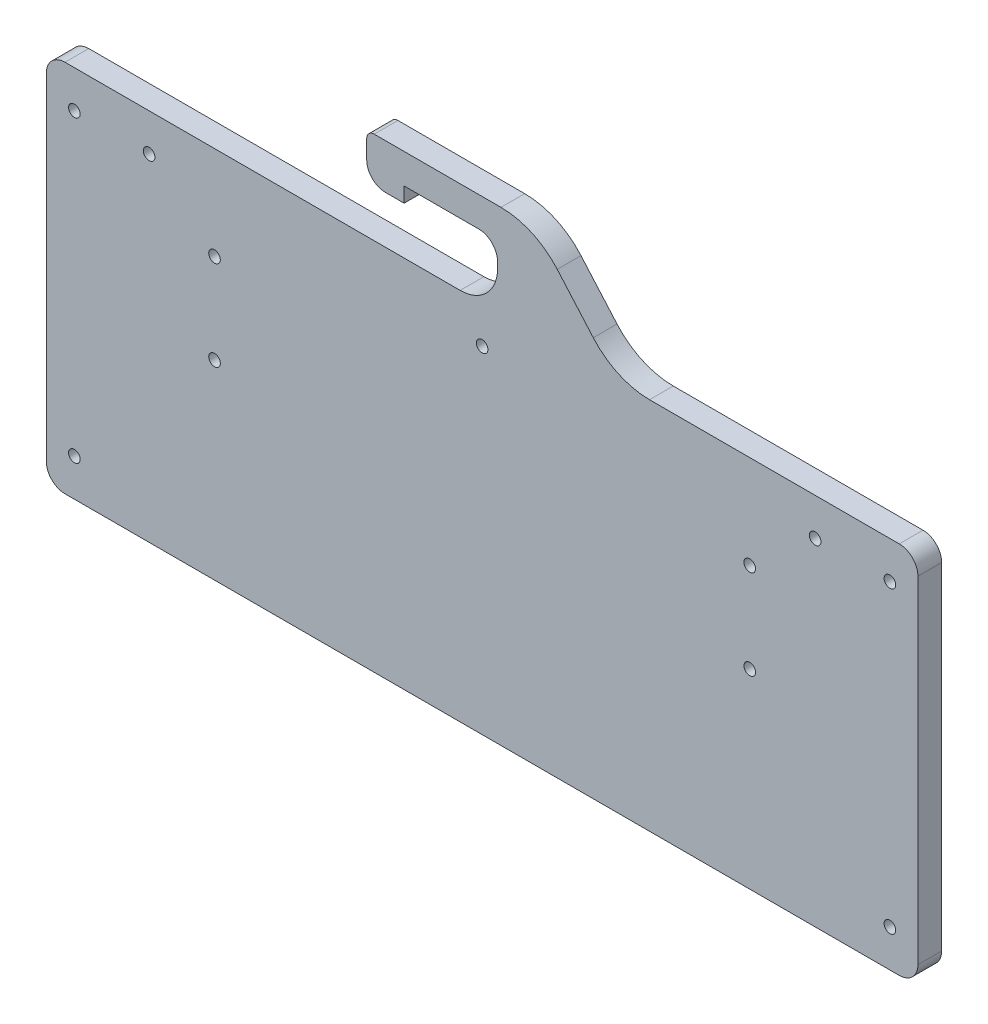
ISO-10303-21;
HEADER;
FILE_DESCRIPTION(('STEP AP214'),'2;1');
FILE_NAME('part.step','',(''),(''),'','','');
FILE_SCHEMA(('AUTOMOTIVE_DESIGN { 1 0 10303 214 1 1 1 1 }'));
ENDSEC;
DATA;
#1=APPLICATION_CONTEXT('core data for automotive mechanical design processes');
#2=APPLICATION_PROTOCOL_DEFINITION('international standard','automotive_design',2000,#1);
#3=PRODUCT_CONTEXT('',#1,'mechanical');
#4=PRODUCT('Part','Part','',(#3));
#5=PRODUCT_RELATED_PRODUCT_CATEGORY('part','',(#4));
#6=PRODUCT_DEFINITION_FORMATION('','',#4);
#7=PRODUCT_DEFINITION_CONTEXT('part definition',#1,'design');
#8=PRODUCT_DEFINITION('design','',#6,#7);
#9=PRODUCT_DEFINITION_SHAPE('','',#8);
#10=(LENGTH_UNIT() NAMED_UNIT(*) SI_UNIT(.MILLI.,.METRE.));
#11=(NAMED_UNIT(*) PLANE_ANGLE_UNIT() SI_UNIT($,.RADIAN.));
#12=(NAMED_UNIT(*) SI_UNIT($,.STERADIAN.) SOLID_ANGLE_UNIT());
#13=UNCERTAINTY_MEASURE_WITH_UNIT(LENGTH_MEASURE(1.E-05),#10,'distance_accuracy_value','');
#14=(GEOMETRIC_REPRESENTATION_CONTEXT(3) GLOBAL_UNCERTAINTY_ASSIGNED_CONTEXT((#13)) GLOBAL_UNIT_ASSIGNED_CONTEXT((#10,
#11,#12)) REPRESENTATION_CONTEXT('',''));
#15=CARTESIAN_POINT('',(0.,0.,0.));
#16=DIRECTION('',(0.,0.,1.));
#17=DIRECTION('',(1.,0.,0.));
#18=AXIS2_PLACEMENT_3D('',#15,#16,#17);
#19=CARTESIAN_POINT('',(0.,0.,6.35));
#20=DIRECTION('',(0.,1.,0.));
#21=DIRECTION('',(0.,0.,1.));
#22=AXIS2_PLACEMENT_3D('',#19,#20,#21);
#23=PLANE('',#22);
#24=DIRECTION('',(1.,0.,0.));
#25=VECTOR('',#24,1.);
#26=CARTESIAN_POINT('',(0.,0.,0.));
#27=LINE('',#26,#25);
#28=CARTESIAN_POINT('',(161.395157905134,0.,0.));
#29=VERTEX_POINT('',#28);
#30=CARTESIAN_POINT('',(228.2,0.,0.));
#31=VERTEX_POINT('',#30);
#32=EDGE_CURVE('E342',#29,#31,#27,.T.);
#33=ORIENTED_EDGE('',*,*,#32,.F.);
#34=DIRECTION('',(0.,0.,1.));
#35=VECTOR('',#34,1.);
#36=CARTESIAN_POINT('',(161.395157905134,0.,6.35));
#37=LINE('',#36,#35);
#38=CARTESIAN_POINT('',(161.395157905134,0.,6.35));
#39=VERTEX_POINT('',#38);
#40=EDGE_CURVE('E466',#29,#39,#37,.T.);
#41=ORIENTED_EDGE('',*,*,#40,.T.);
#42=DIRECTION('',(1.,0.,0.));
#43=VECTOR('',#42,1.);
#44=CARTESIAN_POINT('',(0.,0.,6.35));
#45=LINE('',#44,#43);
#46=CARTESIAN_POINT('',(228.2,0.,6.35));
#47=VERTEX_POINT('',#46);
#48=EDGE_CURVE('E297',#39,#47,#45,.T.);
#49=ORIENTED_EDGE('',*,*,#48,.T.);
#50=DIRECTION('',(0.,0.,-1.));
#51=VECTOR('',#50,1.);
#52=CARTESIAN_POINT('',(228.2,0.,6.35));
#53=LINE('',#52,#51);
#54=EDGE_CURVE('E403',#47,#31,#53,.T.);
#55=ORIENTED_EDGE('',*,*,#54,.T.);
#56=EDGE_LOOP('',(#33,#41,#49,#55));
#57=FACE_BOUND('',#56,.T.);
#58=ADVANCED_FACE('F41',(#57),#23,.T.);
#59=CARTESIAN_POINT('',(5.,0.,6.35));
#60=VERTEX_POINT('',#59);
#61=CARTESIAN_POINT('',(110.723568258825,0.,6.35));
#62=VERTEX_POINT('',#61);
#63=EDGE_CURVE('E298',#60,#62,#45,.T.);
#64=ORIENTED_EDGE('',*,*,#63,.T.);
#65=DIRECTION('',(0.,0.,1.));
#66=VECTOR('',#65,1.);
#67=CARTESIAN_POINT('',(110.723568258825,0.,6.35));
#68=LINE('',#67,#66);
#69=CARTESIAN_POINT('',(110.723568258825,0.,0.));
#70=VERTEX_POINT('',#69);
#71=EDGE_CURVE('E427',#62,#70,#68,.F.);
#72=ORIENTED_EDGE('',*,*,#71,.T.);
#73=CARTESIAN_POINT('',(5.,0.,0.));
#74=VERTEX_POINT('',#73);
#75=EDGE_CURVE('E343',#74,#70,#27,.T.);
#76=ORIENTED_EDGE('',*,*,#75,.F.);
#77=DIRECTION('',(0.,0.,-1.));
#78=VECTOR('',#77,1.);
#79=CARTESIAN_POINT('',(5.,0.,6.35));
#80=LINE('',#79,#78);
#81=EDGE_CURVE('E407',#74,#60,#80,.F.);
#82=ORIENTED_EDGE('',*,*,#81,.T.);
#83=EDGE_LOOP('',(#64,#72,#76,#82));
#84=FACE_BOUND('',#83,.T.);
#85=ADVANCED_FACE('F579',(#84),#23,.T.);
#86=CARTESIAN_POINT('',(0.,0.,6.35));
#87=DIRECTION('',(0.,0.,1.));
#88=DIRECTION('',(1.,0.,0.));
#89=AXIS2_PLACEMENT_3D('',#86,#87,#88);
#90=PLANE('',#89);
#91=CARTESIAN_POINT('',(188.2,-49.,6.35));
#92=DIRECTION('',(0.,0.,-1.));
#93=DIRECTION('',(-1.,0.,0.));
#94=AXIS2_PLACEMENT_3D('',#91,#92,#93);
#95=CIRCLE('',#94,1.55000000000002);
#96=CARTESIAN_POINT('',(186.65,-49.,6.35));
#97=VERTEX_POINT('',#96);
#98=EDGE_CURVE('E245',#97,#97,#95,.T.);
#99=ORIENTED_EDGE('',*,*,#98,.T.);
#100=EDGE_LOOP('',(#99));
#101=FACE_BOUND('',#100,.T.);
#102=CARTESIAN_POINT('',(45.,-49.,6.35));
#103=DIRECTION('',(0.,0.,1.));
#104=DIRECTION('',(1.,0.,0.));
#105=AXIS2_PLACEMENT_3D('',#102,#103,#104);
#106=CIRCLE('',#105,1.55);
#107=CARTESIAN_POINT('',(46.55,-49.,6.35));
#108=VERTEX_POINT('',#107);
#109=EDGE_CURVE('E236',#108,#108,#106,.T.);
#110=ORIENTED_EDGE('',*,*,#109,.F.);
#111=EDGE_LOOP('',(#110));
#112=FACE_BOUND('',#111,.T.);
#113=CARTESIAN_POINT('',(45.,-25.,6.35));
#114=DIRECTION('',(0.,0.,1.));
#115=DIRECTION('',(1.,0.,0.));
#116=AXIS2_PLACEMENT_3D('',#113,#114,#115);
#117=CIRCLE('',#116,1.55);
#118=CARTESIAN_POINT('',(46.55,-25.,6.35));
#119=VERTEX_POINT('',#118);
#120=EDGE_CURVE('E240',#119,#119,#117,.T.);
#121=ORIENTED_EDGE('',*,*,#120,.F.);
#122=EDGE_LOOP('',(#121));
#123=FACE_BOUND('',#122,.T.);
#124=CARTESIAN_POINT('',(116.6,-10.,6.35));
#125=DIRECTION('',(0.,0.,1.));
#126=DIRECTION('',(1.,0.,0.));
#127=AXIS2_PLACEMENT_3D('',#124,#125,#126);
#128=CIRCLE('',#127,1.55000000000001);
#129=CARTESIAN_POINT('',(118.15,-10.,6.35));
#130=VERTEX_POINT('',#129);
#131=EDGE_CURVE('E268',#130,#130,#128,.T.);
#132=ORIENTED_EDGE('',*,*,#131,.F.);
#133=EDGE_LOOP('',(#132));
#134=FACE_BOUND('',#133,.T.);
#135=CARTESIAN_POINT('',(205.7,-10.,6.35));
#136=DIRECTION('',(0.,0.,1.));
#137=DIRECTION('',(1.,0.,0.));
#138=AXIS2_PLACEMENT_3D('',#135,#136,#137);
#139=CIRCLE('',#138,1.54999999999999);
#140=CARTESIAN_POINT('',(207.25,-10.,6.35));
#141=VERTEX_POINT('',#140);
#142=EDGE_CURVE('E272',#141,#141,#139,.T.);
#143=ORIENTED_EDGE('',*,*,#142,.F.);
#144=EDGE_LOOP('',(#143));
#145=FACE_BOUND('',#144,.T.);
#146=CARTESIAN_POINT('',(27.5,-10.,6.35));
#147=DIRECTION('',(0.,0.,1.));
#148=DIRECTION('',(1.,0.,0.));
#149=AXIS2_PLACEMENT_3D('',#146,#147,#148);
#150=CIRCLE('',#149,1.55);
#151=CARTESIAN_POINT('',(29.05,-10.,6.35));
#152=VERTEX_POINT('',#151);
#153=EDGE_CURVE('E277',#152,#152,#150,.T.);
#154=ORIENTED_EDGE('',*,*,#153,.F.);
#155=EDGE_LOOP('',(#154));
#156=FACE_BOUND('',#155,.T.);
#157=CARTESIAN_POINT('',(225.7,-90.,6.35));
#158=DIRECTION('',(0.,0.,1.));
#159=DIRECTION('',(1.,0.,0.));
#160=AXIS2_PLACEMENT_3D('',#157,#158,#159);
#161=CIRCLE('',#160,1.55000000000002);
#162=CARTESIAN_POINT('',(227.25,-90.,6.35));
#163=VERTEX_POINT('',#162);
#164=EDGE_CURVE('E281',#163,#163,#161,.T.);
#165=ORIENTED_EDGE('',*,*,#164,.F.);
#166=EDGE_LOOP('',(#165));
#167=FACE_BOUND('',#166,.T.);
#168=CARTESIAN_POINT('',(225.7,-10.,6.35));
#169=DIRECTION('',(0.,0.,1.));
#170=DIRECTION('',(1.,0.,0.));
#171=AXIS2_PLACEMENT_3D('',#168,#169,#170);
#172=CIRCLE('',#171,1.55000000000002);
#173=CARTESIAN_POINT('',(227.25,-10.,6.35));
#174=VERTEX_POINT('',#173);
#175=EDGE_CURVE('E285',#174,#174,#172,.F.);
#176=ORIENTED_EDGE('',*,*,#175,.T.);
#177=EDGE_LOOP('',(#176));
#178=FACE_BOUND('',#177,.T.);
#179=CARTESIAN_POINT('',(7.5,-10.,6.35));
#180=DIRECTION('',(0.,0.,1.));
#181=DIRECTION('',(1.,0.,0.));
#182=AXIS2_PLACEMENT_3D('',#179,#180,#181);
#183=CIRCLE('',#182,1.55);
#184=CARTESIAN_POINT('',(9.05,-10.,6.35));
#185=VERTEX_POINT('',#184);
#186=EDGE_CURVE('E289',#185,#185,#183,.T.);
#187=ORIENTED_EDGE('',*,*,#186,.F.);
#188=EDGE_LOOP('',(#187));
#189=FACE_BOUND('',#188,.T.);
#190=DIRECTION('',(0.658116071243197,-0.75291648724903,0.));
#191=VECTOR('',#190,1.);
#192=CARTESIAN_POINT('',(86.3440085787674,75.4723540573131,6.35));
#193=LINE('',#192,#191);
#194=CARTESIAN_POINT('',(136.700308357497,17.862321424864,6.35));
#195=VERTEX_POINT('',#194);
#196=CARTESIAN_POINT('',(146.336828160154,6.83767857513608,6.35));
#197=VERTEX_POINT('',#196);
#198=EDGE_CURVE('E504',#195,#197,#193,.T.);
#199=ORIENTED_EDGE('',*,*,#198,.F.);
#200=CARTESIAN_POINT('',(121.641978612516,4.70000000000001,6.34999999999999));
#201=DIRECTION('',(0.,0.,1.));
#202=DIRECTION('',(1.,0.,0.));
#203=AXIS2_PLACEMENT_3D('',#200,#201,#202);
#204=CIRCLE('',#203,20.);
#205=CARTESIAN_POINT('',(121.641978612516,24.7,6.35));
#206=VERTEX_POINT('',#205);
#207=EDGE_CURVE('E457',#195,#206,#204,.T.);
#208=ORIENTED_EDGE('',*,*,#207,.T.);
#209=DIRECTION('',(-1.,0.,0.));
#210=VECTOR('',#209,1.);
#211=CARTESIAN_POINT('',(0.,24.7,6.35));
#212=LINE('',#211,#210);
#213=CARTESIAN_POINT('',(87.7235682588248,24.7,6.35));
#214=VERTEX_POINT('',#213);
#215=EDGE_CURVE('E508',#206,#214,#212,.T.);
#216=ORIENTED_EDGE('',*,*,#215,.T.);
#217=CARTESIAN_POINT('',(87.7235682588248,22.7,6.34999999999999));
#218=DIRECTION('',(0.,0.,1.));
#219=DIRECTION('',(1.,0.,0.));
#220=AXIS2_PLACEMENT_3D('',#217,#218,#219);
#221=CIRCLE('',#220,2.);
#222=CARTESIAN_POINT('',(85.7235682588248,22.7,6.35));
#223=VERTEX_POINT('',#222);
#224=EDGE_CURVE('E441',#214,#223,#221,.T.);
#225=ORIENTED_EDGE('',*,*,#224,.T.);
#226=DIRECTION('',(0.,1.,0.));
#227=VECTOR('',#226,1.);
#228=CARTESIAN_POINT('',(85.7235682588248,0.,6.35));
#229=LINE('',#228,#227);
#230=CARTESIAN_POINT('',(85.7235682588248,17.7,6.35));
#231=VERTEX_POINT('',#230);
#232=EDGE_CURVE('E213',#231,#223,#229,.T.);
#233=ORIENTED_EDGE('',*,*,#232,.F.);
#234=CARTESIAN_POINT('',(90.7235682588248,17.7,6.34999999999999));
#235=DIRECTION('',(0.,0.,1.));
#236=DIRECTION('',(1.,0.,0.));
#237=AXIS2_PLACEMENT_3D('',#234,#235,#236);
#238=CIRCLE('',#237,5.);
#239=CARTESIAN_POINT('',(90.7235682588248,12.7,6.35));
#240=VERTEX_POINT('',#239);
#241=EDGE_CURVE('E211',#231,#240,#238,.T.);
#242=ORIENTED_EDGE('',*,*,#241,.T.);
#243=DIRECTION('',(-1.,0.,0.));
#244=VECTOR('',#243,1.);
#245=CARTESIAN_POINT('',(0.,12.7,6.35));
#246=LINE('',#245,#244);
#247=CARTESIAN_POINT('',(95.7235682588248,12.7,6.35));
#248=VERTEX_POINT('',#247);
#249=EDGE_CURVE('E193',#248,#240,#246,.T.);
#250=ORIENTED_EDGE('',*,*,#249,.F.);
#251=DIRECTION('',(0.,1.,0.));
#252=VECTOR('',#251,1.);
#253=CARTESIAN_POINT('',(95.7235682588248,0.,6.35));
#254=LINE('',#253,#252);
#255=CARTESIAN_POINT('',(95.7235682588248,16.7,6.35));
#256=VERTEX_POINT('',#255);
#257=EDGE_CURVE('E209',#248,#256,#254,.T.);
#258=ORIENTED_EDGE('',*,*,#257,.T.);
#259=DIRECTION('',(-1.,0.,0.));
#260=VECTOR('',#259,1.);
#261=CARTESIAN_POINT('',(0.,16.7,6.35));
#262=LINE('',#261,#260);
#263=CARTESIAN_POINT('',(115.723568258825,16.7,6.35));
#264=VERTEX_POINT('',#263);
#265=EDGE_CURVE('E219',#264,#256,#262,.T.);
#266=ORIENTED_EDGE('',*,*,#265,.F.);
#267=CARTESIAN_POINT('',(115.723568258825,11.7,6.34999999999999));
#268=DIRECTION('',(0.,0.,1.));
#269=DIRECTION('',(1.,0.,0.));
#270=AXIS2_PLACEMENT_3D('',#267,#268,#269);
#271=CIRCLE('',#270,5.);
#272=CARTESIAN_POINT('',(120.723568258825,11.7,6.35));
#273=VERTEX_POINT('',#272);
#274=EDGE_CURVE('E50',#264,#273,#271,.F.);
#275=ORIENTED_EDGE('',*,*,#274,.T.);
#276=DIRECTION('',(0.,1.,0.));
#277=VECTOR('',#276,1.);
#278=CARTESIAN_POINT('',(120.723568258825,0.,6.35));
#279=LINE('',#278,#277);
#280=CARTESIAN_POINT('',(120.723568258825,10.,6.35));
#281=VERTEX_POINT('',#280);
#282=EDGE_CURVE('E203',#281,#273,#279,.T.);
#283=ORIENTED_EDGE('',*,*,#282,.F.);
#284=CARTESIAN_POINT('',(110.723568258825,10.,6.34999999999999));
#285=DIRECTION('',(0.,0.,1.));
#286=DIRECTION('',(1.,0.,0.));
#287=AXIS2_PLACEMENT_3D('',#284,#285,#286);
#288=CIRCLE('',#287,10.);
#289=EDGE_CURVE('E430',#281,#62,#288,.F.);
#290=ORIENTED_EDGE('',*,*,#289,.T.);
#291=ORIENTED_EDGE('',*,*,#63,.F.);
#292=CARTESIAN_POINT('',(5.,-5.,6.35));
#293=DIRECTION('',(0.,0.,1.));
#294=DIRECTION('',(1.,0.,0.));
#295=AXIS2_PLACEMENT_3D('',#292,#293,#294);
#296=CIRCLE('',#295,5.);
#297=CARTESIAN_POINT('',(0.,-5.,6.35));
#298=VERTEX_POINT('',#297);
#299=EDGE_CURVE('E387',#60,#298,#296,.T.);
#300=ORIENTED_EDGE('',*,*,#299,.T.);
#301=DIRECTION('',(0.,-1.,0.));
#302=VECTOR('',#301,1.);
#303=CARTESIAN_POINT('',(0.,0.,6.35));
#304=LINE('',#303,#302);
#305=CARTESIAN_POINT('',(0.,-95.,6.35));
#306=VERTEX_POINT('',#305);
#307=EDGE_CURVE('E302',#298,#306,#304,.T.);
#308=ORIENTED_EDGE('',*,*,#307,.T.);
#309=CARTESIAN_POINT('',(5.,-95.,6.35));
#310=DIRECTION('',(0.,0.,1.));
#311=DIRECTION('',(1.,0.,0.));
#312=AXIS2_PLACEMENT_3D('',#309,#310,#311);
#313=CIRCLE('',#312,5.);
#314=CARTESIAN_POINT('',(5.,-100.,6.35));
#315=VERTEX_POINT('',#314);
#316=EDGE_CURVE('E390',#306,#315,#313,.T.);
#317=ORIENTED_EDGE('',*,*,#316,.T.);
#318=DIRECTION('',(1.,0.,0.));
#319=VECTOR('',#318,1.);
#320=CARTESIAN_POINT('',(0.,-100.,6.35));
#321=LINE('',#320,#319);
#322=CARTESIAN_POINT('',(228.2,-100.,6.35));
#323=VERTEX_POINT('',#322);
#324=EDGE_CURVE('E306',#315,#323,#321,.T.);
#325=ORIENTED_EDGE('',*,*,#324,.T.);
#326=CARTESIAN_POINT('',(228.2,-95.,6.35));
#327=DIRECTION('',(0.,0.,1.));
#328=DIRECTION('',(1.,0.,0.));
#329=AXIS2_PLACEMENT_3D('',#326,#327,#328);
#330=CIRCLE('',#329,5.);
#331=CARTESIAN_POINT('',(233.2,-95.,6.35));
#332=VERTEX_POINT('',#331);
#333=EDGE_CURVE('E393',#323,#332,#330,.T.);
#334=ORIENTED_EDGE('',*,*,#333,.T.);
#335=DIRECTION('',(0.,-1.,0.));
#336=VECTOR('',#335,1.);
#337=CARTESIAN_POINT('',(233.2,0.,6.35));
#338=LINE('',#337,#336);
#339=CARTESIAN_POINT('',(233.2,-5.,6.35));
#340=VERTEX_POINT('',#339);
#341=EDGE_CURVE('E293',#340,#332,#338,.T.);
#342=ORIENTED_EDGE('',*,*,#341,.F.);
#343=CARTESIAN_POINT('',(228.2,-5.,6.35));
#344=DIRECTION('',(0.,0.,1.));
#345=DIRECTION('',(1.,0.,0.));
#346=AXIS2_PLACEMENT_3D('',#343,#344,#345);
#347=CIRCLE('',#346,5.);
#348=EDGE_CURVE('E383',#340,#47,#347,.T.);
#349=ORIENTED_EDGE('',*,*,#348,.T.);
#350=ORIENTED_EDGE('',*,*,#48,.F.);
#351=CARTESIAN_POINT('',(161.395157905134,20.,6.35));
#352=DIRECTION('',(0.,0.,1.));
#353=DIRECTION('',(1.,0.,0.));
#354=AXIS2_PLACEMENT_3D('',#351,#352,#353);
#355=CIRCLE('',#354,20.);
#356=EDGE_CURVE('E470',#39,#197,#355,.F.);
#357=ORIENTED_EDGE('',*,*,#356,.T.);
#358=EDGE_LOOP('',(#199,#208,#216,#225,#233,#242,#250,#258,#266,#275,#283,#290,#291,#300,#308,
#317,#325,#334,#342,#349,#350,#357));
#359=FACE_BOUND('',#358,.T.);
#360=CARTESIAN_POINT('',(7.49999999999999,-90.,6.35));
#361=DIRECTION('',(0.,0.,1.));
#362=DIRECTION('',(1.,0.,0.));
#363=AXIS2_PLACEMENT_3D('',#360,#361,#362);
#364=CIRCLE('',#363,1.55);
#365=CARTESIAN_POINT('',(9.04999999999999,-90.,6.35));
#366=VERTEX_POINT('',#365);
#367=EDGE_CURVE('E310',#366,#366,#364,.F.);
#368=ORIENTED_EDGE('',*,*,#367,.T.);
#369=EDGE_LOOP('',(#368));
#370=FACE_BOUND('',#369,.T.);
#371=CARTESIAN_POINT('',(188.2,-25.,6.35));
#372=DIRECTION('',(0.,0.,-1.));
#373=DIRECTION('',(-1.,0.,0.));
#374=AXIS2_PLACEMENT_3D('',#371,#372,#373);
#375=CIRCLE('',#374,1.55000000000002);
#376=CARTESIAN_POINT('',(186.65,-25.,6.35));
#377=VERTEX_POINT('',#376);
#378=EDGE_CURVE('E253',#377,#377,#375,.T.);
#379=ORIENTED_EDGE('',*,*,#378,.T.);
#380=EDGE_LOOP('',(#379));
#381=FACE_BOUND('',#380,.T.);
#382=ADVANCED_FACE('F207',(#101,#112,#123,#134,#145,#156,#167,#178,#189,#359,#370,#381),#90,.T.);
#383=CARTESIAN_POINT('',(0.,0.,0.));
#384=DIRECTION('',(0.,0.,1.));
#385=DIRECTION('',(1.,0.,0.));
#386=AXIS2_PLACEMENT_3D('',#383,#384,#385);
#387=PLANE('',#386);
#388=CARTESIAN_POINT('',(45.,-49.,0.));
#389=DIRECTION('',(0.,0.,1.));
#390=DIRECTION('',(1.,0.,0.));
#391=AXIS2_PLACEMENT_3D('',#388,#389,#390);
#392=CIRCLE('',#391,1.55);
#393=CARTESIAN_POINT('',(46.55,-49.,0.));
#394=VERTEX_POINT('',#393);
#395=EDGE_CURVE('E241',#394,#394,#392,.T.);
#396=ORIENTED_EDGE('',*,*,#395,.T.);
#397=EDGE_LOOP('',(#396));
#398=FACE_BOUND('',#397,.T.);
#399=CARTESIAN_POINT('',(45.,-25.,0.));
#400=DIRECTION('',(0.,0.,1.));
#401=DIRECTION('',(1.,0.,0.));
#402=AXIS2_PLACEMENT_3D('',#399,#400,#401);
#403=CIRCLE('',#402,1.55);
#404=CARTESIAN_POINT('',(46.55,-25.,0.));
#405=VERTEX_POINT('',#404);
#406=EDGE_CURVE('E260',#405,#405,#403,.T.);
#407=ORIENTED_EDGE('',*,*,#406,.T.);
#408=EDGE_LOOP('',(#407));
#409=FACE_BOUND('',#408,.T.);
#410=CARTESIAN_POINT('',(116.6,-10.,0.));
#411=DIRECTION('',(0.,0.,1.));
#412=DIRECTION('',(1.,0.,0.));
#413=AXIS2_PLACEMENT_3D('',#410,#411,#412);
#414=CIRCLE('',#413,1.55000000000001);
#415=CARTESIAN_POINT('',(118.15,-10.,0.));
#416=VERTEX_POINT('',#415);
#417=EDGE_CURVE('E264',#416,#416,#414,.T.);
#418=ORIENTED_EDGE('',*,*,#417,.T.);
#419=EDGE_LOOP('',(#418));
#420=FACE_BOUND('',#419,.T.);
#421=CARTESIAN_POINT('',(205.7,-10.,0.));
#422=DIRECTION('',(0.,0.,1.));
#423=DIRECTION('',(1.,0.,0.));
#424=AXIS2_PLACEMENT_3D('',#421,#422,#423);
#425=CIRCLE('',#424,1.54999999999999);
#426=CARTESIAN_POINT('',(207.25,-10.,0.));
#427=VERTEX_POINT('',#426);
#428=EDGE_CURVE('E318',#427,#427,#425,.T.);
#429=ORIENTED_EDGE('',*,*,#428,.T.);
#430=EDGE_LOOP('',(#429));
#431=FACE_BOUND('',#430,.T.);
#432=CARTESIAN_POINT('',(27.5,-10.,0.));
#433=DIRECTION('',(0.,0.,1.));
#434=DIRECTION('',(1.,0.,0.));
#435=AXIS2_PLACEMENT_3D('',#432,#433,#434);
#436=CIRCLE('',#435,1.55);
#437=CARTESIAN_POINT('',(29.05,-10.,0.));
#438=VERTEX_POINT('',#437);
#439=EDGE_CURVE('E322',#438,#438,#436,.T.);
#440=ORIENTED_EDGE('',*,*,#439,.T.);
#441=EDGE_LOOP('',(#440));
#442=FACE_BOUND('',#441,.T.);
#443=CARTESIAN_POINT('',(225.7,-90.,0.));
#444=DIRECTION('',(0.,0.,1.));
#445=DIRECTION('',(1.,0.,0.));
#446=AXIS2_PLACEMENT_3D('',#443,#444,#445);
#447=CIRCLE('',#446,1.55000000000002);
#448=CARTESIAN_POINT('',(227.25,-90.,0.));
#449=VERTEX_POINT('',#448);
#450=EDGE_CURVE('E326',#449,#449,#447,.T.);
#451=ORIENTED_EDGE('',*,*,#450,.T.);
#452=EDGE_LOOP('',(#451));
#453=FACE_BOUND('',#452,.T.);
#454=CARTESIAN_POINT('',(225.7,-10.,0.));
#455=DIRECTION('',(0.,0.,1.));
#456=DIRECTION('',(1.,0.,0.));
#457=AXIS2_PLACEMENT_3D('',#454,#455,#456);
#458=CIRCLE('',#457,1.55000000000002);
#459=CARTESIAN_POINT('',(227.25,-10.,0.));
#460=VERTEX_POINT('',#459);
#461=EDGE_CURVE('E330',#460,#460,#458,.F.);
#462=ORIENTED_EDGE('',*,*,#461,.F.);
#463=EDGE_LOOP('',(#462));
#464=FACE_BOUND('',#463,.T.);
#465=CARTESIAN_POINT('',(7.5,-10.,0.));
#466=DIRECTION('',(0.,0.,1.));
#467=DIRECTION('',(1.,0.,0.));
#468=AXIS2_PLACEMENT_3D('',#465,#466,#467);
#469=CIRCLE('',#468,1.55);
#470=CARTESIAN_POINT('',(9.05,-10.,0.));
#471=VERTEX_POINT('',#470);
#472=EDGE_CURVE('E334',#471,#471,#469,.T.);
#473=ORIENTED_EDGE('',*,*,#472,.T.);
#474=EDGE_LOOP('',(#473));
#475=FACE_BOUND('',#474,.T.);
#476=DIRECTION('',(1.,0.,0.));
#477=VECTOR('',#476,1.);
#478=CARTESIAN_POINT('',(0.,24.7,0.));
#479=LINE('',#478,#477);
#480=CARTESIAN_POINT('',(87.7235682588248,24.7,0.));
#481=VERTEX_POINT('',#480);
#482=CARTESIAN_POINT('',(121.641978612516,24.7,0.));
#483=VERTEX_POINT('',#482);
#484=EDGE_CURVE('E230',#481,#483,#479,.T.);
#485=ORIENTED_EDGE('',*,*,#484,.T.);
#486=CARTESIAN_POINT('',(121.641978612516,4.70000000000001,0.));
#487=DIRECTION('',(0.,0.,1.));
#488=DIRECTION('',(1.,0.,0.));
#489=AXIS2_PLACEMENT_3D('',#486,#487,#488);
#490=CIRCLE('',#489,20.);
#491=CARTESIAN_POINT('',(136.700308357497,17.8623214248639,0.));
#492=VERTEX_POINT('',#491);
#493=EDGE_CURVE('E463',#483,#492,#490,.F.);
#494=ORIENTED_EDGE('',*,*,#493,.T.);
#495=DIRECTION('',(-0.658116071243197,0.752916487249031,0.));
#496=VECTOR('',#495,1.);
#497=CARTESIAN_POINT('',(86.3440085787674,75.4723540573131,0.));
#498=LINE('',#497,#496);
#499=CARTESIAN_POINT('',(146.336828160154,6.83767857513605,0.));
#500=VERTEX_POINT('',#499);
#501=EDGE_CURVE('E235',#500,#492,#498,.T.);
#502=ORIENTED_EDGE('',*,*,#501,.F.);
#503=CARTESIAN_POINT('',(161.395157905134,20.,0.));
#504=DIRECTION('',(0.,0.,1.));
#505=DIRECTION('',(1.,0.,0.));
#506=AXIS2_PLACEMENT_3D('',#503,#504,#505);
#507=CIRCLE('',#506,20.);
#508=EDGE_CURVE('E473',#500,#29,#507,.T.);
#509=ORIENTED_EDGE('',*,*,#508,.T.);
#510=ORIENTED_EDGE('',*,*,#32,.T.);
#511=CARTESIAN_POINT('',(228.2,-5.,0.));
#512=DIRECTION('',(0.,0.,1.));
#513=DIRECTION('',(1.,0.,0.));
#514=AXIS2_PLACEMENT_3D('',#511,#512,#513);
#515=CIRCLE('',#514,5.);
#516=CARTESIAN_POINT('',(233.2,-5.,0.));
#517=VERTEX_POINT('',#516);
#518=EDGE_CURVE('E364',#31,#517,#515,.F.);
#519=ORIENTED_EDGE('',*,*,#518,.T.);
#520=DIRECTION('',(0.,-1.,0.));
#521=VECTOR('',#520,1.);
#522=CARTESIAN_POINT('',(233.2,0.,0.));
#523=LINE('',#522,#521);
#524=CARTESIAN_POINT('',(233.2,-95.,0.));
#525=VERTEX_POINT('',#524);
#526=EDGE_CURVE('E338',#517,#525,#523,.T.);
#527=ORIENTED_EDGE('',*,*,#526,.T.);
#528=CARTESIAN_POINT('',(228.2,-95.,0.));
#529=DIRECTION('',(0.,0.,1.));
#530=DIRECTION('',(1.,0.,0.));
#531=AXIS2_PLACEMENT_3D('',#528,#529,#530);
#532=CIRCLE('',#531,5.);
#533=CARTESIAN_POINT('',(228.2,-100.,0.));
#534=VERTEX_POINT('',#533);
#535=EDGE_CURVE('E373',#525,#534,#532,.F.);
#536=ORIENTED_EDGE('',*,*,#535,.T.);
#537=DIRECTION('',(1.,0.,0.));
#538=VECTOR('',#537,1.);
#539=CARTESIAN_POINT('',(0.,-100.,0.));
#540=LINE('',#539,#538);
#541=CARTESIAN_POINT('',(5.,-100.,0.));
#542=VERTEX_POINT('',#541);
#543=EDGE_CURVE('E351',#542,#534,#540,.T.);
#544=ORIENTED_EDGE('',*,*,#543,.F.);
#545=CARTESIAN_POINT('',(5.,-95.,0.));
#546=DIRECTION('',(0.,0.,1.));
#547=DIRECTION('',(1.,0.,0.));
#548=AXIS2_PLACEMENT_3D('',#545,#546,#547);
#549=CIRCLE('',#548,5.);
#550=CARTESIAN_POINT('',(0.,-95.,0.));
#551=VERTEX_POINT('',#550);
#552=EDGE_CURVE('E370',#542,#551,#549,.F.);
#553=ORIENTED_EDGE('',*,*,#552,.T.);
#554=DIRECTION('',(0.,-1.,0.));
#555=VECTOR('',#554,1.);
#556=CARTESIAN_POINT('',(0.,0.,0.));
#557=LINE('',#556,#555);
#558=CARTESIAN_POINT('',(0.,-5.,0.));
#559=VERTEX_POINT('',#558);
#560=EDGE_CURVE('E347',#559,#551,#557,.T.);
#561=ORIENTED_EDGE('',*,*,#560,.F.);
#562=CARTESIAN_POINT('',(5.,-5.,0.));
#563=DIRECTION('',(0.,0.,1.));
#564=DIRECTION('',(1.,0.,0.));
#565=AXIS2_PLACEMENT_3D('',#562,#563,#564);
#566=CIRCLE('',#565,5.);
#567=EDGE_CURVE('E367',#559,#74,#566,.F.);
#568=ORIENTED_EDGE('',*,*,#567,.T.);
#569=ORIENTED_EDGE('',*,*,#75,.T.);
#570=CARTESIAN_POINT('',(110.723568258825,10.,0.));
#571=DIRECTION('',(0.,0.,1.));
#572=DIRECTION('',(1.,0.,0.));
#573=AXIS2_PLACEMENT_3D('',#570,#571,#572);
#574=CIRCLE('',#573,10.);
#575=CARTESIAN_POINT('',(120.723568258825,10.,0.));
#576=VERTEX_POINT('',#575);
#577=EDGE_CURVE('E433',#70,#576,#574,.T.);
#578=ORIENTED_EDGE('',*,*,#577,.T.);
#579=DIRECTION('',(0.,-1.,0.));
#580=VECTOR('',#579,1.);
#581=CARTESIAN_POINT('',(120.723568258825,0.,0.));
#582=LINE('',#581,#580);
#583=CARTESIAN_POINT('',(120.723568258825,11.7,0.));
#584=VERTEX_POINT('',#583);
#585=EDGE_CURVE('E487',#584,#576,#582,.T.);
#586=ORIENTED_EDGE('',*,*,#585,.F.);
#587=CARTESIAN_POINT('',(115.723568258825,11.7,0.));
#588=DIRECTION('',(0.,0.,1.));
#589=DIRECTION('',(1.,0.,0.));
#590=AXIS2_PLACEMENT_3D('',#587,#588,#589);
#591=CIRCLE('',#590,5.);
#592=CARTESIAN_POINT('',(115.723568258825,16.7,0.));
#593=VERTEX_POINT('',#592);
#594=EDGE_CURVE('E11',#584,#593,#591,.T.);
#595=ORIENTED_EDGE('',*,*,#594,.T.);
#596=DIRECTION('',(1.,0.,0.));
#597=VECTOR('',#596,1.);
#598=CARTESIAN_POINT('',(0.,16.7,0.));
#599=LINE('',#598,#597);
#600=CARTESIAN_POINT('',(95.7235682588248,16.7,0.));
#601=VERTEX_POINT('',#600);
#602=EDGE_CURVE('E490',#601,#593,#599,.T.);
#603=ORIENTED_EDGE('',*,*,#602,.F.);
#604=DIRECTION('',(0.,-1.,0.));
#605=VECTOR('',#604,1.);
#606=CARTESIAN_POINT('',(95.7235682588248,0.,0.));
#607=LINE('',#606,#605);
#608=CARTESIAN_POINT('',(95.7235682588248,12.7,0.));
#609=VERTEX_POINT('',#608);
#610=EDGE_CURVE('E494',#601,#609,#607,.T.);
#611=ORIENTED_EDGE('',*,*,#610,.T.);
#612=DIRECTION('',(1.,0.,0.));
#613=VECTOR('',#612,1.);
#614=CARTESIAN_POINT('',(0.,12.7,0.));
#615=LINE('',#614,#613);
#616=CARTESIAN_POINT('',(90.7235682588248,12.7,0.));
#617=VERTEX_POINT('',#616);
#618=EDGE_CURVE('E196',#617,#609,#615,.T.);
#619=ORIENTED_EDGE('',*,*,#618,.F.);
#620=CARTESIAN_POINT('',(90.7235682588248,17.7,0.));
#621=DIRECTION('',(0.,0.,1.));
#622=DIRECTION('',(1.,0.,0.));
#623=AXIS2_PLACEMENT_3D('',#620,#621,#622);
#624=CIRCLE('',#623,5.);
#625=CARTESIAN_POINT('',(85.7235682588248,17.7,0.));
#626=VERTEX_POINT('',#625);
#627=EDGE_CURVE('E419',#617,#626,#624,.F.);
#628=ORIENTED_EDGE('',*,*,#627,.T.);
#629=DIRECTION('',(0.,-1.,0.));
#630=VECTOR('',#629,1.);
#631=CARTESIAN_POINT('',(85.7235682588248,0.,0.));
#632=LINE('',#631,#630);
#633=CARTESIAN_POINT('',(85.7235682588248,22.7,0.));
#634=VERTEX_POINT('',#633);
#635=EDGE_CURVE('E228',#634,#626,#632,.T.);
#636=ORIENTED_EDGE('',*,*,#635,.F.);
#637=CARTESIAN_POINT('',(87.7235682588248,22.7,0.));
#638=DIRECTION('',(0.,0.,1.));
#639=DIRECTION('',(1.,0.,0.));
#640=AXIS2_PLACEMENT_3D('',#637,#638,#639);
#641=CIRCLE('',#640,2.);
#642=EDGE_CURVE('E447',#634,#481,#641,.F.);
#643=ORIENTED_EDGE('',*,*,#642,.T.);
#644=EDGE_LOOP('',(#485,#494,#502,#509,#510,#519,#527,#536,#544,#553,#561,#568,#569,#578,#586,
#595,#603,#611,#619,#628,#636,#643));
#645=FACE_BOUND('',#644,.T.);
#646=CARTESIAN_POINT('',(7.49999999999999,-90.,0.));
#647=DIRECTION('',(0.,0.,1.));
#648=DIRECTION('',(1.,0.,0.));
#649=AXIS2_PLACEMENT_3D('',#646,#647,#648);
#650=CIRCLE('',#649,1.55);
#651=CARTESIAN_POINT('',(9.04999999999999,-90.,0.));
#652=VERTEX_POINT('',#651);
#653=EDGE_CURVE('E273',#652,#652,#650,.F.);
#654=ORIENTED_EDGE('',*,*,#653,.F.);
#655=EDGE_LOOP('',(#654));
#656=FACE_BOUND('',#655,.T.);
#657=CARTESIAN_POINT('',(188.2,-49.,0.));
#658=DIRECTION('',(0.,0.,-1.));
#659=DIRECTION('',(-1.,0.,0.));
#660=AXIS2_PLACEMENT_3D('',#657,#658,#659);
#661=CIRCLE('',#660,1.55000000000002);
#662=CARTESIAN_POINT('',(186.65,-49.,0.));
#663=VERTEX_POINT('',#662);
#664=EDGE_CURVE('E249',#663,#663,#661,.T.);
#665=ORIENTED_EDGE('',*,*,#664,.F.);
#666=EDGE_LOOP('',(#665));
#667=FACE_BOUND('',#666,.T.);
#668=CARTESIAN_POINT('',(188.2,-25.,0.));
#669=DIRECTION('',(0.,0.,-1.));
#670=DIRECTION('',(-1.,0.,0.));
#671=AXIS2_PLACEMENT_3D('',#668,#669,#670);
#672=CIRCLE('',#671,1.55000000000002);
#673=CARTESIAN_POINT('',(186.65,-25.,0.));
#674=VERTEX_POINT('',#673);
#675=EDGE_CURVE('E234',#674,#674,#672,.T.);
#676=ORIENTED_EDGE('',*,*,#675,.F.);
#677=EDGE_LOOP('',(#676));
#678=FACE_BOUND('',#677,.T.);
#679=ADVANCED_FACE('F522',(#398,#409,#420,#431,#442,#453,#464,#475,#645,#656,#667,#678),#387,.F.);
#680=CARTESIAN_POINT('',(233.2,0.,6.35));
#681=DIRECTION('',(1.,0.,0.));
#682=DIRECTION('',(0.,0.,-1.));
#683=AXIS2_PLACEMENT_3D('',#680,#681,#682);
#684=PLANE('',#683);
#685=ORIENTED_EDGE('',*,*,#341,.T.);
#686=DIRECTION('',(0.,0.,-1.));
#687=VECTOR('',#686,1.);
#688=CARTESIAN_POINT('',(233.2,-95.,0.));
#689=LINE('',#688,#687);
#690=EDGE_CURVE('E360',#332,#525,#689,.T.);
#691=ORIENTED_EDGE('',*,*,#690,.T.);
#692=ORIENTED_EDGE('',*,*,#526,.F.);
#693=DIRECTION('',(0.,0.,-1.));
#694=VECTOR('',#693,1.);
#695=CARTESIAN_POINT('',(233.2,-5.,6.35));
#696=LINE('',#695,#694);
#697=EDGE_CURVE('E314',#517,#340,#696,.F.);
#698=ORIENTED_EDGE('',*,*,#697,.T.);
#699=EDGE_LOOP('',(#685,#691,#692,#698));
#700=FACE_BOUND('',#699,.T.);
#701=ADVANCED_FACE('F551',(#700),#684,.T.);
#702=CARTESIAN_POINT('',(0.,0.,6.35));
#703=DIRECTION('',(1.,0.,0.));
#704=DIRECTION('',(0.,0.,-1.));
#705=AXIS2_PLACEMENT_3D('',#702,#703,#704);
#706=PLANE('',#705);
#707=ORIENTED_EDGE('',*,*,#560,.T.);
#708=DIRECTION('',(0.,0.,-1.));
#709=VECTOR('',#708,1.);
#710=CARTESIAN_POINT('',(0.,-95.,6.35));
#711=LINE('',#710,#709);
#712=EDGE_CURVE('E400',#551,#306,#711,.F.);
#713=ORIENTED_EDGE('',*,*,#712,.T.);
#714=ORIENTED_EDGE('',*,*,#307,.F.);
#715=DIRECTION('',(0.,0.,-1.));
#716=VECTOR('',#715,1.);
#717=CARTESIAN_POINT('',(0.,-5.,0.));
#718=LINE('',#717,#716);
#719=EDGE_CURVE('E396',#298,#559,#718,.T.);
#720=ORIENTED_EDGE('',*,*,#719,.T.);
#721=EDGE_LOOP('',(#707,#713,#714,#720));
#722=FACE_BOUND('',#721,.T.);
#723=ADVANCED_FACE('F569',(#722),#706,.F.);
#724=CARTESIAN_POINT('',(0.,-100.,6.35));
#725=DIRECTION('',(0.,1.,0.));
#726=DIRECTION('',(0.,0.,1.));
#727=AXIS2_PLACEMENT_3D('',#724,#725,#726);
#728=PLANE('',#727);
#729=ORIENTED_EDGE('',*,*,#543,.T.);
#730=DIRECTION('',(0.,0.,-1.));
#731=VECTOR('',#730,1.);
#732=CARTESIAN_POINT('',(228.2,-100.,6.35));
#733=LINE('',#732,#731);
#734=EDGE_CURVE('E380',#534,#323,#733,.F.);
#735=ORIENTED_EDGE('',*,*,#734,.T.);
#736=ORIENTED_EDGE('',*,*,#324,.F.);
#737=DIRECTION('',(0.,0.,-1.));
#738=VECTOR('',#737,1.);
#739=CARTESIAN_POINT('',(5.,-100.,6.35));
#740=LINE('',#739,#738);
#741=EDGE_CURVE('E376',#315,#542,#740,.T.);
#742=ORIENTED_EDGE('',*,*,#741,.T.);
#743=EDGE_LOOP('',(#729,#735,#736,#742));
#744=FACE_BOUND('',#743,.T.);
#745=ADVANCED_FACE('F560',(#744),#728,.F.);
#746=CARTESIAN_POINT('',(7.5,-10.,6.35));
#747=DIRECTION('',(0.,0.,-1.));
#748=DIRECTION('',(-1.,0.,0.));
#749=AXIS2_PLACEMENT_3D('',#746,#747,#748);
#750=CYLINDRICAL_SURFACE('',#749,1.55);
#751=ORIENTED_EDGE('',*,*,#186,.T.);
#752=EDGE_LOOP('',(#751));
#753=FACE_BOUND('',#752,.T.);
#754=ORIENTED_EDGE('',*,*,#472,.F.);
#755=EDGE_LOOP('',(#754));
#756=FACE_BOUND('',#755,.T.);
#757=ADVANCED_FACE('F612',(#753,#756),#750,.F.);
#758=CARTESIAN_POINT('',(225.7,-10.,6.35));
#759=DIRECTION('',(0.,0.,-1.));
#760=DIRECTION('',(-1.,0.,0.));
#761=AXIS2_PLACEMENT_3D('',#758,#759,#760);
#762=CYLINDRICAL_SURFACE('',#761,1.55000000000002);
#763=ORIENTED_EDGE('',*,*,#175,.F.);
#764=EDGE_LOOP('',(#763));
#765=FACE_BOUND('',#764,.T.);
#766=ORIENTED_EDGE('',*,*,#461,.T.);
#767=EDGE_LOOP('',(#766));
#768=FACE_BOUND('',#767,.T.);
#769=ADVANCED_FACE('F615',(#765,#768),#762,.F.);
#770=CARTESIAN_POINT('',(225.7,-90.,6.35));
#771=DIRECTION('',(0.,0.,-1.));
#772=DIRECTION('',(-1.,0.,0.));
#773=AXIS2_PLACEMENT_3D('',#770,#771,#772);
#774=CYLINDRICAL_SURFACE('',#773,1.55000000000002);
#775=ORIENTED_EDGE('',*,*,#164,.T.);
#776=EDGE_LOOP('',(#775));
#777=FACE_BOUND('',#776,.T.);
#778=ORIENTED_EDGE('',*,*,#450,.F.);
#779=EDGE_LOOP('',(#778));
#780=FACE_BOUND('',#779,.T.);
#781=ADVANCED_FACE('F619',(#777,#780),#774,.F.);
#782=CARTESIAN_POINT('',(27.5,-10.,6.35));
#783=DIRECTION('',(0.,0.,-1.));
#784=DIRECTION('',(-1.,0.,0.));
#785=AXIS2_PLACEMENT_3D('',#782,#783,#784);
#786=CYLINDRICAL_SURFACE('',#785,1.55);
#787=ORIENTED_EDGE('',*,*,#153,.T.);
#788=EDGE_LOOP('',(#787));
#789=FACE_BOUND('',#788,.T.);
#790=ORIENTED_EDGE('',*,*,#439,.F.);
#791=EDGE_LOOP('',(#790));
#792=FACE_BOUND('',#791,.T.);
#793=ADVANCED_FACE('F623',(#789,#792),#786,.F.);
#794=CARTESIAN_POINT('',(205.7,-10.,6.35));
#795=DIRECTION('',(0.,0.,-1.));
#796=DIRECTION('',(-1.,0.,0.));
#797=AXIS2_PLACEMENT_3D('',#794,#795,#796);
#798=CYLINDRICAL_SURFACE('',#797,1.54999999999999);
#799=ORIENTED_EDGE('',*,*,#142,.T.);
#800=EDGE_LOOP('',(#799));
#801=FACE_BOUND('',#800,.T.);
#802=ORIENTED_EDGE('',*,*,#428,.F.);
#803=EDGE_LOOP('',(#802));
#804=FACE_BOUND('',#803,.T.);
#805=ADVANCED_FACE('F627',(#801,#804),#798,.F.);
#806=CARTESIAN_POINT('',(116.6,-10.,6.35));
#807=DIRECTION('',(0.,0.,-1.));
#808=DIRECTION('',(-1.,0.,0.));
#809=AXIS2_PLACEMENT_3D('',#806,#807,#808);
#810=CYLINDRICAL_SURFACE('',#809,1.55000000000001);
#811=ORIENTED_EDGE('',*,*,#131,.T.);
#812=EDGE_LOOP('',(#811));
#813=FACE_BOUND('',#812,.T.);
#814=ORIENTED_EDGE('',*,*,#417,.F.);
#815=EDGE_LOOP('',(#814));
#816=FACE_BOUND('',#815,.T.);
#817=ADVANCED_FACE('F631',(#813,#816),#810,.F.);
#818=CARTESIAN_POINT('',(7.49999999999999,-90.,6.35));
#819=DIRECTION('',(0.,0.,-1.));
#820=DIRECTION('',(-1.,0.,0.));
#821=AXIS2_PLACEMENT_3D('',#818,#819,#820);
#822=CYLINDRICAL_SURFACE('',#821,1.55);
#823=ORIENTED_EDGE('',*,*,#367,.F.);
#824=EDGE_LOOP('',(#823));
#825=FACE_BOUND('',#824,.T.);
#826=ORIENTED_EDGE('',*,*,#653,.T.);
#827=EDGE_LOOP('',(#826));
#828=FACE_BOUND('',#827,.T.);
#829=ADVANCED_FACE('F635',(#825,#828),#822,.F.);
#830=CARTESIAN_POINT('',(228.2,-95.,6.35));
#831=DIRECTION('',(0.,0.,1.));
#832=DIRECTION('',(1.,0.,0.));
#833=AXIS2_PLACEMENT_3D('',#830,#831,#832);
#834=CYLINDRICAL_SURFACE('',#833,5.);
#835=ORIENTED_EDGE('',*,*,#333,.F.);
#836=ORIENTED_EDGE('',*,*,#734,.F.);
#837=ORIENTED_EDGE('',*,*,#535,.F.);
#838=ORIENTED_EDGE('',*,*,#690,.F.);
#839=EDGE_LOOP('',(#835,#836,#837,#838));
#840=FACE_BOUND('',#839,.T.);
#841=ADVANCED_FACE('F556',(#840),#834,.T.);
#842=CARTESIAN_POINT('',(5.,-95.,6.35));
#843=DIRECTION('',(0.,0.,-1.));
#844=DIRECTION('',(-1.,0.,0.));
#845=AXIS2_PLACEMENT_3D('',#842,#843,#844);
#846=CYLINDRICAL_SURFACE('',#845,5.);
#847=ORIENTED_EDGE('',*,*,#316,.F.);
#848=ORIENTED_EDGE('',*,*,#712,.F.);
#849=ORIENTED_EDGE('',*,*,#552,.F.);
#850=ORIENTED_EDGE('',*,*,#741,.F.);
#851=EDGE_LOOP('',(#847,#848,#849,#850));
#852=FACE_BOUND('',#851,.T.);
#853=ADVANCED_FACE('F565',(#852),#846,.T.);
#854=CARTESIAN_POINT('',(5.,-5.,6.35));
#855=DIRECTION('',(0.,0.,1.));
#856=DIRECTION('',(1.,0.,0.));
#857=AXIS2_PLACEMENT_3D('',#854,#855,#856);
#858=CYLINDRICAL_SURFACE('',#857,5.);
#859=ORIENTED_EDGE('',*,*,#299,.F.);
#860=ORIENTED_EDGE('',*,*,#81,.F.);
#861=ORIENTED_EDGE('',*,*,#567,.F.);
#862=ORIENTED_EDGE('',*,*,#719,.F.);
#863=EDGE_LOOP('',(#859,#860,#861,#862));
#864=FACE_BOUND('',#863,.T.);
#865=ADVANCED_FACE('F574',(#864),#858,.T.);
#866=CARTESIAN_POINT('',(228.2,-5.,6.35));
#867=DIRECTION('',(0.,0.,-1.));
#868=DIRECTION('',(-1.,0.,0.));
#869=AXIS2_PLACEMENT_3D('',#866,#867,#868);
#870=CYLINDRICAL_SURFACE('',#869,5.);
#871=ORIENTED_EDGE('',*,*,#348,.F.);
#872=ORIENTED_EDGE('',*,*,#697,.F.);
#873=ORIENTED_EDGE('',*,*,#518,.F.);
#874=ORIENTED_EDGE('',*,*,#54,.F.);
#875=EDGE_LOOP('',(#871,#872,#873,#874));
#876=FACE_BOUND('',#875,.T.);
#877=ADVANCED_FACE('F547',(#876),#870,.T.);
#878=CARTESIAN_POINT('',(45.,-25.,0.));
#879=DIRECTION('',(0.,0.,1.));
#880=DIRECTION('',(1.,0.,0.));
#881=AXIS2_PLACEMENT_3D('',#878,#879,#880);
#882=CYLINDRICAL_SURFACE('',#881,1.55);
#883=ORIENTED_EDGE('',*,*,#406,.F.);
#884=EDGE_LOOP('',(#883));
#885=FACE_BOUND('',#884,.T.);
#886=ORIENTED_EDGE('',*,*,#120,.T.);
#887=EDGE_LOOP('',(#886));
#888=FACE_BOUND('',#887,.T.);
#889=ADVANCED_FACE('F643',(#885,#888),#882,.F.);
#890=CARTESIAN_POINT('',(45.,-49.,0.));
#891=DIRECTION('',(0.,0.,1.));
#892=DIRECTION('',(1.,0.,0.));
#893=AXIS2_PLACEMENT_3D('',#890,#891,#892);
#894=CYLINDRICAL_SURFACE('',#893,1.55);
#895=ORIENTED_EDGE('',*,*,#395,.F.);
#896=EDGE_LOOP('',(#895));
#897=FACE_BOUND('',#896,.T.);
#898=ORIENTED_EDGE('',*,*,#109,.T.);
#899=EDGE_LOOP('',(#898));
#900=FACE_BOUND('',#899,.T.);
#901=ADVANCED_FACE('F647',(#897,#900),#894,.F.);
#902=CARTESIAN_POINT('',(188.2,-49.,0.));
#903=DIRECTION('',(0.,0.,1.));
#904=DIRECTION('',(1.,0.,0.));
#905=AXIS2_PLACEMENT_3D('',#902,#903,#904);
#906=CYLINDRICAL_SURFACE('',#905,1.55000000000002);
#907=ORIENTED_EDGE('',*,*,#664,.T.);
#908=EDGE_LOOP('',(#907));
#909=FACE_BOUND('',#908,.T.);
#910=ORIENTED_EDGE('',*,*,#98,.F.);
#911=EDGE_LOOP('',(#910));
#912=FACE_BOUND('',#911,.T.);
#913=ADVANCED_FACE('F653',(#909,#912),#906,.F.);
#914=CARTESIAN_POINT('',(188.2,-25.,0.));
#915=DIRECTION('',(0.,0.,1.));
#916=DIRECTION('',(1.,0.,0.));
#917=AXIS2_PLACEMENT_3D('',#914,#915,#916);
#918=CYLINDRICAL_SURFACE('',#917,1.55000000000002);
#919=ORIENTED_EDGE('',*,*,#675,.T.);
#920=EDGE_LOOP('',(#919));
#921=FACE_BOUND('',#920,.T.);
#922=ORIENTED_EDGE('',*,*,#378,.F.);
#923=EDGE_LOOP('',(#922));
#924=FACE_BOUND('',#923,.T.);
#925=ADVANCED_FACE('F660',(#921,#924),#918,.F.);
#926=CARTESIAN_POINT('',(86.3440085787674,75.4723540573131,-71.0233630575184));
#927=DIRECTION('',(-0.75291648724903,-0.658116071243197,0.));
#928=DIRECTION('',(0.658116071243197,-0.752916487249031,0.));
#929=AXIS2_PLACEMENT_3D('',#926,#927,#928);
#930=PLANE('',#929);
#931=ORIENTED_EDGE('',*,*,#501,.T.);
#932=DIRECTION('',(0.,0.,1.));
#933=VECTOR('',#932,1.);
#934=CARTESIAN_POINT('',(136.700308357497,17.8623214248639,6.34999999999999));
#935=LINE('',#934,#933);
#936=EDGE_CURVE('E453',#492,#195,#935,.T.);
#937=ORIENTED_EDGE('',*,*,#936,.T.);
#938=ORIENTED_EDGE('',*,*,#198,.T.);
#939=DIRECTION('',(0.,0.,1.));
#940=VECTOR('',#939,1.);
#941=CARTESIAN_POINT('',(146.336828160154,6.83767857513606,-71.0233630575184));
#942=LINE('',#941,#940);
#943=EDGE_CURVE('E450',#197,#500,#942,.F.);
#944=ORIENTED_EDGE('',*,*,#943,.T.);
#945=EDGE_LOOP('',(#931,#937,#938,#944));
#946=FACE_BOUND('',#945,.T.);
#947=ADVANCED_FACE('F535',(#946),#930,.F.);
#948=CARTESIAN_POINT('',(120.723568258825,0.,-71.0233630575184));
#949=DIRECTION('',(1.,0.,0.));
#950=DIRECTION('',(0.,0.,-1.));
#951=AXIS2_PLACEMENT_3D('',#948,#949,#950);
#952=PLANE('',#951);
#953=ORIENTED_EDGE('',*,*,#282,.T.);
#954=DIRECTION('',(0.,0.,1.));
#955=VECTOR('',#954,1.);
#956=CARTESIAN_POINT('',(120.723568258825,11.7,0.));
#957=LINE('',#956,#955);
#958=EDGE_CURVE('E63',#273,#584,#957,.F.);
#959=ORIENTED_EDGE('',*,*,#958,.T.);
#960=ORIENTED_EDGE('',*,*,#585,.T.);
#961=DIRECTION('',(0.,0.,1.));
#962=VECTOR('',#961,1.);
#963=CARTESIAN_POINT('',(120.723568258825,10.,-71.0233630575184));
#964=LINE('',#963,#962);
#965=EDGE_CURVE('E423',#576,#281,#964,.T.);
#966=ORIENTED_EDGE('',*,*,#965,.T.);
#967=EDGE_LOOP('',(#953,#959,#960,#966));
#968=FACE_BOUND('',#967,.T.);
#969=ADVANCED_FACE('F742',(#968),#952,.F.);
#970=CARTESIAN_POINT('',(0.,16.7,-71.0233630575184));
#971=DIRECTION('',(0.,1.,0.));
#972=DIRECTION('',(-1.,0.,0.));
#973=AXIS2_PLACEMENT_3D('',#970,#971,#972);
#974=PLANE('',#973);
#975=ORIENTED_EDGE('',*,*,#602,.T.);
#976=DIRECTION('',(0.,0.,1.));
#977=VECTOR('',#976,1.);
#978=CARTESIAN_POINT('',(115.723568258825,16.7,6.34999999999999));
#979=LINE('',#978,#977);
#980=EDGE_CURVE('E476',#593,#264,#979,.T.);
#981=ORIENTED_EDGE('',*,*,#980,.T.);
#982=ORIENTED_EDGE('',*,*,#265,.T.);
#983=DIRECTION('',(0.,0.,1.));
#984=VECTOR('',#983,1.);
#985=CARTESIAN_POINT('',(95.7235682588248,16.7,-71.0233630575184));
#986=LINE('',#985,#984);
#987=EDGE_CURVE('E202',#601,#256,#986,.T.);
#988=ORIENTED_EDGE('',*,*,#987,.F.);
#989=EDGE_LOOP('',(#975,#981,#982,#988));
#990=FACE_BOUND('',#989,.T.);
#991=ADVANCED_FACE('F589',(#990),#974,.F.);
#992=CARTESIAN_POINT('',(95.7235682588248,0.,-71.0233630575184));
#993=DIRECTION('',(1.,0.,0.));
#994=DIRECTION('',(0.,0.,-1.));
#995=AXIS2_PLACEMENT_3D('',#992,#993,#994);
#996=PLANE('',#995);
#997=ORIENTED_EDGE('',*,*,#610,.F.);
#998=ORIENTED_EDGE('',*,*,#987,.T.);
#999=ORIENTED_EDGE('',*,*,#257,.F.);
#1000=DIRECTION('',(0.,0.,1.));
#1001=VECTOR('',#1000,1.);
#1002=CARTESIAN_POINT('',(95.7235682588248,12.7,-71.0233630575184));
#1003=LINE('',#1002,#1001);
#1004=EDGE_CURVE('E190',#609,#248,#1003,.T.);
#1005=ORIENTED_EDGE('',*,*,#1004,.F.);
#1006=EDGE_LOOP('',(#997,#998,#999,#1005));
#1007=FACE_BOUND('',#1006,.T.);
#1008=ADVANCED_FACE('F216',(#1007),#996,.T.);
#1009=CARTESIAN_POINT('',(0.,12.7,-71.0233630575184));
#1010=DIRECTION('',(0.,1.,0.));
#1011=DIRECTION('',(-1.,0.,0.));
#1012=AXIS2_PLACEMENT_3D('',#1009,#1010,#1011);
#1013=PLANE('',#1012);
#1014=ORIENTED_EDGE('',*,*,#249,.T.);
#1015=DIRECTION('',(0.,0.,1.));
#1016=VECTOR('',#1015,1.);
#1017=CARTESIAN_POINT('',(90.7235682588248,12.7,-71.0233630575184));
#1018=LINE('',#1017,#1016);
#1019=EDGE_CURVE('E416',#240,#617,#1018,.F.);
#1020=ORIENTED_EDGE('',*,*,#1019,.T.);
#1021=ORIENTED_EDGE('',*,*,#618,.T.);
#1022=ORIENTED_EDGE('',*,*,#1004,.T.);
#1023=EDGE_LOOP('',(#1014,#1020,#1021,#1022));
#1024=FACE_BOUND('',#1023,.T.);
#1025=ADVANCED_FACE('F192',(#1024),#1013,.F.);
#1026=CARTESIAN_POINT('',(85.7235682588248,0.,-71.0233630575184));
#1027=DIRECTION('',(1.,0.,0.));
#1028=DIRECTION('',(0.,0.,-1.));
#1029=AXIS2_PLACEMENT_3D('',#1026,#1027,#1028);
#1030=PLANE('',#1029);
#1031=ORIENTED_EDGE('',*,*,#232,.T.);
#1032=DIRECTION('',(0.,0.,1.));
#1033=VECTOR('',#1032,1.);
#1034=CARTESIAN_POINT('',(85.7235682588248,22.7,0.));
#1035=LINE('',#1034,#1033);
#1036=EDGE_CURVE('E444',#223,#634,#1035,.F.);
#1037=ORIENTED_EDGE('',*,*,#1036,.T.);
#1038=ORIENTED_EDGE('',*,*,#635,.T.);
#1039=DIRECTION('',(0.,0.,1.));
#1040=VECTOR('',#1039,1.);
#1041=CARTESIAN_POINT('',(85.7235682588248,17.7,-71.0233630575184));
#1042=LINE('',#1041,#1040);
#1043=EDGE_CURVE('E410',#626,#231,#1042,.T.);
#1044=ORIENTED_EDGE('',*,*,#1043,.T.);
#1045=EDGE_LOOP('',(#1031,#1037,#1038,#1044));
#1046=FACE_BOUND('',#1045,.T.);
#1047=ADVANCED_FACE('F513',(#1046),#1030,.F.);
#1048=CARTESIAN_POINT('',(0.,24.7,-71.0233630575184));
#1049=DIRECTION('',(0.,1.,0.));
#1050=DIRECTION('',(-1.,0.,0.));
#1051=AXIS2_PLACEMENT_3D('',#1048,#1049,#1050);
#1052=PLANE('',#1051);
#1053=ORIENTED_EDGE('',*,*,#215,.F.);
#1054=DIRECTION('',(0.,0.,1.));
#1055=VECTOR('',#1054,1.);
#1056=CARTESIAN_POINT('',(121.641978612516,24.7,0.));
#1057=LINE('',#1056,#1055);
#1058=EDGE_CURVE('E460',#206,#483,#1057,.F.);
#1059=ORIENTED_EDGE('',*,*,#1058,.T.);
#1060=ORIENTED_EDGE('',*,*,#484,.F.);
#1061=DIRECTION('',(0.,0.,1.));
#1062=VECTOR('',#1061,1.);
#1063=CARTESIAN_POINT('',(87.7235682588248,24.7,6.34999999999999));
#1064=LINE('',#1063,#1062);
#1065=EDGE_CURVE('E437',#481,#214,#1064,.T.);
#1066=ORIENTED_EDGE('',*,*,#1065,.T.);
#1067=EDGE_LOOP('',(#1053,#1059,#1060,#1066));
#1068=FACE_BOUND('',#1067,.T.);
#1069=ADVANCED_FACE('F527',(#1068),#1052,.T.);
#1070=CARTESIAN_POINT('',(90.7235682588248,17.7,-71.0233630575184));
#1071=DIRECTION('',(0.,0.,1.));
#1072=DIRECTION('',(1.,0.,0.));
#1073=AXIS2_PLACEMENT_3D('',#1070,#1071,#1072);
#1074=CYLINDRICAL_SURFACE('',#1073,5.);
#1075=ORIENTED_EDGE('',*,*,#627,.F.);
#1076=ORIENTED_EDGE('',*,*,#1019,.F.);
#1077=ORIENTED_EDGE('',*,*,#241,.F.);
#1078=ORIENTED_EDGE('',*,*,#1043,.F.);
#1079=EDGE_LOOP('',(#1075,#1076,#1077,#1078));
#1080=FACE_BOUND('',#1079,.T.);
#1081=ADVANCED_FACE('F592',(#1080),#1074,.T.);
#1082=CARTESIAN_POINT('',(110.723568258825,10.,-71.0233630575184));
#1083=DIRECTION('',(0.,0.,1.));
#1084=DIRECTION('',(1.,0.,0.));
#1085=AXIS2_PLACEMENT_3D('',#1082,#1083,#1084);
#1086=CYLINDRICAL_SURFACE('',#1085,10.);
#1087=ORIENTED_EDGE('',*,*,#577,.F.);
#1088=ORIENTED_EDGE('',*,*,#71,.F.);
#1089=ORIENTED_EDGE('',*,*,#289,.F.);
#1090=ORIENTED_EDGE('',*,*,#965,.F.);
#1091=EDGE_LOOP('',(#1087,#1088,#1089,#1090));
#1092=FACE_BOUND('',#1091,.T.);
#1093=ADVANCED_FACE('F583',(#1092),#1086,.F.);
#1094=CARTESIAN_POINT('',(87.7235682588248,22.7,-71.0233630575184));
#1095=DIRECTION('',(0.,0.,-1.));
#1096=DIRECTION('',(-1.,0.,0.));
#1097=AXIS2_PLACEMENT_3D('',#1094,#1095,#1096);
#1098=CYLINDRICAL_SURFACE('',#1097,2.);
#1099=ORIENTED_EDGE('',*,*,#642,.F.);
#1100=ORIENTED_EDGE('',*,*,#1036,.F.);
#1101=ORIENTED_EDGE('',*,*,#224,.F.);
#1102=ORIENTED_EDGE('',*,*,#1065,.F.);
#1103=EDGE_LOOP('',(#1099,#1100,#1101,#1102));
#1104=FACE_BOUND('',#1103,.T.);
#1105=ADVANCED_FACE('F518',(#1104),#1098,.T.);
#1106=CARTESIAN_POINT('',(121.641978612516,4.70000000000001,-71.0233630575184));
#1107=DIRECTION('',(0.,0.,-1.));
#1108=DIRECTION('',(-1.,0.,0.));
#1109=AXIS2_PLACEMENT_3D('',#1106,#1107,#1108);
#1110=CYLINDRICAL_SURFACE('',#1109,20.);
#1111=ORIENTED_EDGE('',*,*,#493,.F.);
#1112=ORIENTED_EDGE('',*,*,#1058,.F.);
#1113=ORIENTED_EDGE('',*,*,#207,.F.);
#1114=ORIENTED_EDGE('',*,*,#936,.F.);
#1115=EDGE_LOOP('',(#1111,#1112,#1113,#1114));
#1116=FACE_BOUND('',#1115,.T.);
#1117=ADVANCED_FACE('F530',(#1116),#1110,.T.);
#1118=CARTESIAN_POINT('',(161.395157905134,20.,6.35));
#1119=DIRECTION('',(0.,0.,1.));
#1120=DIRECTION('',(1.,0.,0.));
#1121=AXIS2_PLACEMENT_3D('',#1118,#1119,#1120);
#1122=CYLINDRICAL_SURFACE('',#1121,20.);
#1123=ORIENTED_EDGE('',*,*,#508,.F.);
#1124=ORIENTED_EDGE('',*,*,#943,.F.);
#1125=ORIENTED_EDGE('',*,*,#356,.F.);
#1126=ORIENTED_EDGE('',*,*,#40,.F.);
#1127=EDGE_LOOP('',(#1123,#1124,#1125,#1126));
#1128=FACE_BOUND('',#1127,.T.);
#1129=ADVANCED_FACE('F538',(#1128),#1122,.F.);
#1130=CARTESIAN_POINT('',(115.723568258825,11.7,-71.0233630575184));
#1131=DIRECTION('',(0.,0.,-1.));
#1132=DIRECTION('',(-1.,0.,0.));
#1133=AXIS2_PLACEMENT_3D('',#1130,#1131,#1132);
#1134=CYLINDRICAL_SURFACE('',#1133,5.);
#1135=ORIENTED_EDGE('',*,*,#594,.F.);
#1136=ORIENTED_EDGE('',*,*,#958,.F.);
#1137=ORIENTED_EDGE('',*,*,#274,.F.);
#1138=ORIENTED_EDGE('',*,*,#980,.F.);
#1139=EDGE_LOOP('',(#1135,#1136,#1137,#1138));
#1140=FACE_BOUND('',#1139,.T.);
#1141=ADVANCED_FACE('F43',(#1140),#1134,.F.);
#1142=CLOSED_SHELL('',(#58,#85,#382,#679,#701,#723,#745,#757,#769,#781,#793,#805,#817,#829,#841,
#853,#865,#877,#889,#901,#913,#925,#947,#969,#991,#1008,#1025,#1047,#1069,#1081,#1093,#1105,
#1117,#1129,#1141));
#1143=MANIFOLD_SOLID_BREP('B2',#1142);
#1144=ADVANCED_BREP_SHAPE_REPRESENTATION('',(#18,#1143),#14);
#1145=SHAPE_DEFINITION_REPRESENTATION(#9,#1144);
ENDSEC;
END-ISO-10303-21;
